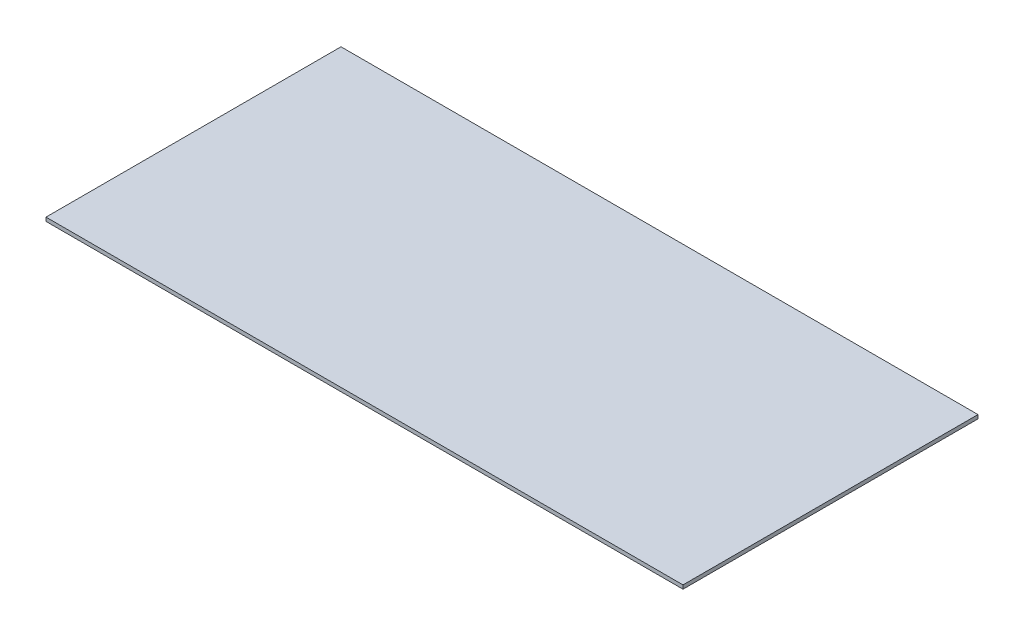
ISO-10303-21;
HEADER;
FILE_DESCRIPTION(('STEP AP214'),'2;1');
FILE_NAME('part.step','',(''),(''),'','','');
FILE_SCHEMA(('AUTOMOTIVE_DESIGN { 1 0 10303 214 1 1 1 1 }'));
ENDSEC;
DATA;
#1=APPLICATION_CONTEXT('core data for automotive mechanical design processes');
#2=APPLICATION_PROTOCOL_DEFINITION('international standard','automotive_design',2000,#1);
#3=PRODUCT_CONTEXT('',#1,'mechanical');
#4=PRODUCT('Part','Part','',(#3));
#5=PRODUCT_RELATED_PRODUCT_CATEGORY('part','',(#4));
#6=PRODUCT_DEFINITION_FORMATION('','',#4);
#7=PRODUCT_DEFINITION_CONTEXT('part definition',#1,'design');
#8=PRODUCT_DEFINITION('design','',#6,#7);
#9=PRODUCT_DEFINITION_SHAPE('','',#8);
#10=(LENGTH_UNIT() NAMED_UNIT(*) SI_UNIT(.MILLI.,.METRE.));
#11=(NAMED_UNIT(*) PLANE_ANGLE_UNIT() SI_UNIT($,.RADIAN.));
#12=(NAMED_UNIT(*) SI_UNIT($,.STERADIAN.) SOLID_ANGLE_UNIT());
#13=UNCERTAINTY_MEASURE_WITH_UNIT(LENGTH_MEASURE(1.E-05),#10,'distance_accuracy_value','');
#14=(GEOMETRIC_REPRESENTATION_CONTEXT(3) GLOBAL_UNCERTAINTY_ASSIGNED_CONTEXT((#13)) GLOBAL_UNIT_ASSIGNED_CONTEXT((#10,
#11,#12)) REPRESENTATION_CONTEXT('',''));
#15=CARTESIAN_POINT('',(0.,0.,0.));
#16=DIRECTION('',(0.,0.,1.));
#17=DIRECTION('',(1.,0.,0.));
#18=AXIS2_PLACEMENT_3D('',#15,#16,#17);
#19=CARTESIAN_POINT('',(-538.1625,6.35,249.2375));
#20=DIRECTION('',(1.,0.,0.));
#21=DIRECTION('',(0.,0.,-1.));
#22=AXIS2_PLACEMENT_3D('',#19,#20,#21);
#23=PLANE('',#22);
#24=DIRECTION('',(0.,0.,1.));
#25=VECTOR('',#24,1.);
#26=CARTESIAN_POINT('',(-538.1625,0.,249.2375));
#27=LINE('',#26,#25);
#28=CARTESIAN_POINT('',(-538.1625,0.,-249.2375));
#29=VERTEX_POINT('',#28);
#30=CARTESIAN_POINT('',(-538.1625,0.,249.2375));
#31=VERTEX_POINT('',#30);
#32=EDGE_CURVE('E96',#29,#31,#27,.T.);
#33=ORIENTED_EDGE('',*,*,#32,.T.);
#34=DIRECTION('',(0.,-1.,0.));
#35=VECTOR('',#34,1.);
#36=CARTESIAN_POINT('',(-538.1625,6.35,249.2375));
#37=LINE('',#36,#35);
#38=CARTESIAN_POINT('',(-538.1625,6.35,249.2375));
#39=VERTEX_POINT('',#38);
#40=EDGE_CURVE('E11',#39,#31,#37,.T.);
#41=ORIENTED_EDGE('',*,*,#40,.F.);
#42=DIRECTION('',(0.,0.,1.));
#43=VECTOR('',#42,1.);
#44=CARTESIAN_POINT('',(-538.1625,6.35,249.2375));
#45=LINE('',#44,#43);
#46=CARTESIAN_POINT('',(-538.1625,6.35,-249.2375));
#47=VERTEX_POINT('',#46);
#48=EDGE_CURVE('E84',#47,#39,#45,.T.);
#49=ORIENTED_EDGE('',*,*,#48,.F.);
#50=DIRECTION('',(0.,-1.,0.));
#51=VECTOR('',#50,1.);
#52=CARTESIAN_POINT('',(-538.1625,6.35,-249.2375));
#53=LINE('',#52,#51);
#54=EDGE_CURVE('E92',#47,#29,#53,.T.);
#55=ORIENTED_EDGE('',*,*,#54,.T.);
#56=EDGE_LOOP('',(#33,#41,#49,#55));
#57=FACE_BOUND('',#56,.T.);
#58=ADVANCED_FACE('F33',(#57),#23,.F.);
#59=CARTESIAN_POINT('',(538.1625,6.35,249.2375));
#60=DIRECTION('',(0.,0.,-1.));
#61=DIRECTION('',(-1.,0.,0.));
#62=AXIS2_PLACEMENT_3D('',#59,#60,#61);
#63=PLANE('',#62);
#64=DIRECTION('',(1.,0.,0.));
#65=VECTOR('',#64,1.);
#66=CARTESIAN_POINT('',(538.1625,0.,249.2375));
#67=LINE('',#66,#65);
#68=CARTESIAN_POINT('',(538.1625,0.,249.2375));
#69=VERTEX_POINT('',#68);
#70=EDGE_CURVE('E88',#31,#69,#67,.T.);
#71=ORIENTED_EDGE('',*,*,#70,.T.);
#72=DIRECTION('',(0.,-1.,0.));
#73=VECTOR('',#72,1.);
#74=CARTESIAN_POINT('',(538.1625,6.35,249.2375));
#75=LINE('',#74,#73);
#76=CARTESIAN_POINT('',(538.1625,6.35,249.2375));
#77=VERTEX_POINT('',#76);
#78=EDGE_CURVE('E41',#77,#69,#75,.T.);
#79=ORIENTED_EDGE('',*,*,#78,.F.);
#80=DIRECTION('',(1.,0.,0.));
#81=VECTOR('',#80,1.);
#82=CARTESIAN_POINT('',(538.1625,6.35,249.2375));
#83=LINE('',#82,#81);
#84=EDGE_CURVE('E79',#39,#77,#83,.T.);
#85=ORIENTED_EDGE('',*,*,#84,.F.);
#86=ORIENTED_EDGE('',*,*,#40,.T.);
#87=EDGE_LOOP('',(#71,#79,#85,#86));
#88=FACE_BOUND('',#87,.T.);
#89=ADVANCED_FACE('F87',(#88),#63,.F.);
#90=CARTESIAN_POINT('',(538.1625,6.35,249.2375));
#91=DIRECTION('',(-1.,0.,0.));
#92=DIRECTION('',(0.,0.,1.));
#93=AXIS2_PLACEMENT_3D('',#90,#91,#92);
#94=PLANE('',#93);
#95=DIRECTION('',(0.,0.,-1.));
#96=VECTOR('',#95,1.);
#97=CARTESIAN_POINT('',(538.1625,0.,249.2375));
#98=LINE('',#97,#96);
#99=CARTESIAN_POINT('',(538.1625,0.,-249.2375));
#100=VERTEX_POINT('',#99);
#101=EDGE_CURVE('E66',#69,#100,#98,.T.);
#102=ORIENTED_EDGE('',*,*,#101,.T.);
#103=DIRECTION('',(0.,-1.,0.));
#104=VECTOR('',#103,1.);
#105=CARTESIAN_POINT('',(538.1625,6.35,-249.2375));
#106=LINE('',#105,#104);
#107=CARTESIAN_POINT('',(538.1625,6.35,-249.2375));
#108=VERTEX_POINT('',#107);
#109=EDGE_CURVE('E89',#108,#100,#106,.T.);
#110=ORIENTED_EDGE('',*,*,#109,.F.);
#111=DIRECTION('',(0.,0.,-1.));
#112=VECTOR('',#111,1.);
#113=CARTESIAN_POINT('',(538.1625,6.35,249.2375));
#114=LINE('',#113,#112);
#115=EDGE_CURVE('E82',#77,#108,#114,.T.);
#116=ORIENTED_EDGE('',*,*,#115,.F.);
#117=ORIENTED_EDGE('',*,*,#78,.T.);
#118=EDGE_LOOP('',(#102,#110,#116,#117));
#119=FACE_BOUND('',#118,.T.);
#120=ADVANCED_FACE('F90',(#119),#94,.F.);
#121=CARTESIAN_POINT('',(538.1625,6.35,-249.2375));
#122=DIRECTION('',(0.,0.,1.));
#123=DIRECTION('',(1.,0.,0.));
#124=AXIS2_PLACEMENT_3D('',#121,#122,#123);
#125=PLANE('',#124);
#126=DIRECTION('',(-1.,0.,0.));
#127=VECTOR('',#126,1.);
#128=CARTESIAN_POINT('',(538.1625,0.,-249.2375));
#129=LINE('',#128,#127);
#130=EDGE_CURVE('E72',#100,#29,#129,.T.);
#131=ORIENTED_EDGE('',*,*,#130,.T.);
#132=ORIENTED_EDGE('',*,*,#54,.F.);
#133=DIRECTION('',(-1.,0.,0.));
#134=VECTOR('',#133,1.);
#135=CARTESIAN_POINT('',(538.1625,6.35,-249.2375));
#136=LINE('',#135,#134);
#137=EDGE_CURVE('E49',#108,#47,#136,.T.);
#138=ORIENTED_EDGE('',*,*,#137,.F.);
#139=ORIENTED_EDGE('',*,*,#109,.T.);
#140=EDGE_LOOP('',(#131,#132,#138,#139));
#141=FACE_BOUND('',#140,.T.);
#142=ADVANCED_FACE('F103',(#141),#125,.F.);
#143=CARTESIAN_POINT('',(0.,6.35,0.));
#144=DIRECTION('',(0.,1.,0.));
#145=DIRECTION('',(0.,0.,1.));
#146=AXIS2_PLACEMENT_3D('',#143,#144,#145);
#147=PLANE('',#146);
#148=ORIENTED_EDGE('',*,*,#48,.T.);
#149=ORIENTED_EDGE('',*,*,#84,.T.);
#150=ORIENTED_EDGE('',*,*,#115,.T.);
#151=ORIENTED_EDGE('',*,*,#137,.T.);
#152=EDGE_LOOP('',(#148,#149,#150,#151));
#153=FACE_BOUND('',#152,.T.);
#154=ADVANCED_FACE('F80',(#153),#147,.T.);
#155=CARTESIAN_POINT('',(0.,0.,0.));
#156=DIRECTION('',(0.,1.,0.));
#157=DIRECTION('',(0.,0.,1.));
#158=AXIS2_PLACEMENT_3D('',#155,#156,#157);
#159=PLANE('',#158);
#160=ORIENTED_EDGE('',*,*,#32,.F.);
#161=ORIENTED_EDGE('',*,*,#130,.F.);
#162=ORIENTED_EDGE('',*,*,#101,.F.);
#163=ORIENTED_EDGE('',*,*,#70,.F.);
#164=EDGE_LOOP('',(#160,#161,#162,#163));
#165=FACE_BOUND('',#164,.T.);
#166=ADVANCED_FACE('F106',(#165),#159,.F.);
#167=CLOSED_SHELL('',(#58,#89,#120,#142,#154,#166));
#168=MANIFOLD_SOLID_BREP('B2',#167);
#169=ADVANCED_BREP_SHAPE_REPRESENTATION('',(#18,#168),#14);
#170=SHAPE_DEFINITION_REPRESENTATION(#9,#169);
ENDSEC;
END-ISO-10303-21;
